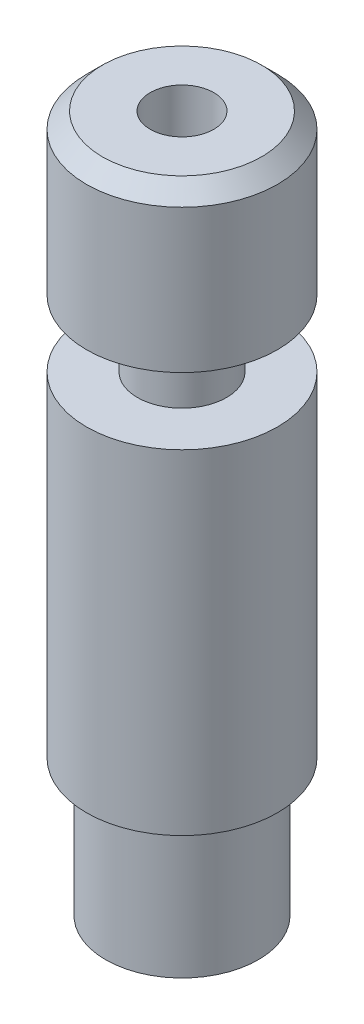
ISO-10303-21;
HEADER;
FILE_DESCRIPTION(('STEP AP214'),'2;1');
FILE_NAME('part.step','',(''),(''),'','','');
FILE_SCHEMA(('AUTOMOTIVE_DESIGN { 1 0 10303 214 1 1 1 1 }'));
ENDSEC;
DATA;
#1=APPLICATION_CONTEXT('core data for automotive mechanical design processes');
#2=APPLICATION_PROTOCOL_DEFINITION('international standard','automotive_design',2000,#1);
#3=PRODUCT_CONTEXT('',#1,'mechanical');
#4=PRODUCT('Part','Part','',(#3));
#5=PRODUCT_RELATED_PRODUCT_CATEGORY('part','',(#4));
#6=PRODUCT_DEFINITION_FORMATION('','',#4);
#7=PRODUCT_DEFINITION_CONTEXT('part definition',#1,'design');
#8=PRODUCT_DEFINITION('design','',#6,#7);
#9=PRODUCT_DEFINITION_SHAPE('','',#8);
#10=(LENGTH_UNIT() NAMED_UNIT(*) SI_UNIT(.MILLI.,.METRE.));
#11=(NAMED_UNIT(*) PLANE_ANGLE_UNIT() SI_UNIT($,.RADIAN.));
#12=(NAMED_UNIT(*) SI_UNIT($,.STERADIAN.) SOLID_ANGLE_UNIT());
#13=UNCERTAINTY_MEASURE_WITH_UNIT(LENGTH_MEASURE(1.E-05),#10,'distance_accuracy_value','');
#14=(GEOMETRIC_REPRESENTATION_CONTEXT(3) GLOBAL_UNCERTAINTY_ASSIGNED_CONTEXT((#13)) GLOBAL_UNIT_ASSIGNED_CONTEXT((#10,
#11,#12)) REPRESENTATION_CONTEXT('',''));
#15=CARTESIAN_POINT('',(0.,0.,0.));
#16=DIRECTION('',(0.,0.,1.));
#17=DIRECTION('',(1.,0.,0.));
#18=AXIS2_PLACEMENT_3D('',#15,#16,#17);
#19=CARTESIAN_POINT('',(1.,11.0943375672974,0.));
#20=DIRECTION('',(0.,-1.,0.));
#21=DIRECTION('',(0.,0.,-1.));
#22=AXIS2_PLACEMENT_3D('',#19,#20,#21);
#23=PLANE('',#22);
#24=CARTESIAN_POINT('',(0.,11.0943375672974,0.));
#25=DIRECTION('',(0.,1.,0.));
#26=DIRECTION('',(0.,0.,1.));
#27=AXIS2_PLACEMENT_3D('',#24,#25,#26);
#28=CIRCLE('',#27,1.);
#29=CARTESIAN_POINT('',(0.,11.0943375672974,1.));
#30=VERTEX_POINT('',#29);
#31=EDGE_CURVE('E74',#30,#30,#28,.T.);
#32=ORIENTED_EDGE('',*,*,#31,.F.);
#33=EDGE_LOOP('',(#32));
#34=FACE_BOUND('',#33,.T.);
#35=CARTESIAN_POINT('',(0.,11.0943375672974,0.));
#36=DIRECTION('',(0.,1.,0.));
#37=DIRECTION('',(0.,0.,1.));
#38=AXIS2_PLACEMENT_3D('',#35,#36,#37);
#39=CIRCLE('',#38,2.5);
#40=CARTESIAN_POINT('',(0.,11.0943375672974,2.5));
#41=VERTEX_POINT('',#40);
#42=EDGE_CURVE('E10',#41,#41,#39,.T.);
#43=ORIENTED_EDGE('',*,*,#42,.T.);
#44=EDGE_LOOP('',(#43));
#45=FACE_BOUND('',#44,.T.);
#46=ADVANCED_FACE('F31',(#34,#45),#23,.F.);
#47=CARTESIAN_POINT('',(0.,10.5943375672974,0.));
#48=DIRECTION('',(0.,-1.,0.));
#49=DIRECTION('',(0.,0.,-1.));
#50=AXIS2_PLACEMENT_3D('',#47,#48,#49);
#51=CONICAL_SURFACE('',#50,3.,0.785398163397447);
#52=ORIENTED_EDGE('',*,*,#42,.F.);
#53=EDGE_LOOP('',(#52));
#54=FACE_BOUND('',#53,.T.);
#55=CARTESIAN_POINT('',(0.,10.5943375672974,0.));
#56=DIRECTION('',(0.,1.,0.));
#57=DIRECTION('',(0.,0.,1.));
#58=AXIS2_PLACEMENT_3D('',#55,#56,#57);
#59=CIRCLE('',#58,3.);
#60=CARTESIAN_POINT('',(0.,10.5943375672974,3.));
#61=VERTEX_POINT('',#60);
#62=EDGE_CURVE('E37',#61,#61,#59,.T.);
#63=ORIENTED_EDGE('',*,*,#62,.T.);
#64=EDGE_LOOP('',(#63));
#65=FACE_BOUND('',#64,.T.);
#66=ADVANCED_FACE('F81',(#54,#65),#51,.T.);
#67=CARTESIAN_POINT('',(0.,11.0943375672974,0.));
#68=DIRECTION('',(0.,1.,0.));
#69=DIRECTION('',(0.,0.,1.));
#70=AXIS2_PLACEMENT_3D('',#67,#68,#69);
#71=CYLINDRICAL_SURFACE('',#70,3.);
#72=ORIENTED_EDGE('',*,*,#62,.F.);
#73=EDGE_LOOP('',(#72));
#74=FACE_BOUND('',#73,.T.);
#75=CARTESIAN_POINT('',(0.,6.09433756729741,0.));
#76=DIRECTION('',(0.,1.,0.));
#77=DIRECTION('',(0.,0.,1.));
#78=AXIS2_PLACEMENT_3D('',#75,#76,#77);
#79=CIRCLE('',#78,3.);
#80=CARTESIAN_POINT('',(0.,6.09433756729741,3.));
#81=VERTEX_POINT('',#80);
#82=EDGE_CURVE('E41',#81,#81,#79,.T.);
#83=ORIENTED_EDGE('',*,*,#82,.T.);
#84=EDGE_LOOP('',(#83));
#85=FACE_BOUND('',#84,.T.);
#86=ADVANCED_FACE('F85',(#74,#85),#71,.T.);
#87=CARTESIAN_POINT('',(3.,6.09433756729741,0.));
#88=DIRECTION('',(0.,1.,0.));
#89=DIRECTION('',(0.,0.,1.));
#90=AXIS2_PLACEMENT_3D('',#87,#88,#89);
#91=PLANE('',#90);
#92=ORIENTED_EDGE('',*,*,#82,.F.);
#93=EDGE_LOOP('',(#92));
#94=FACE_BOUND('',#93,.T.);
#95=CARTESIAN_POINT('',(0.,6.09433756729741,0.));
#96=DIRECTION('',(0.,1.,0.));
#97=DIRECTION('',(0.,0.,1.));
#98=AXIS2_PLACEMENT_3D('',#95,#96,#97);
#99=CIRCLE('',#98,1.4);
#100=CARTESIAN_POINT('',(0.,6.09433756729741,1.4));
#101=VERTEX_POINT('',#100);
#102=EDGE_CURVE('E45',#101,#101,#99,.T.);
#103=ORIENTED_EDGE('',*,*,#102,.T.);
#104=EDGE_LOOP('',(#103));
#105=FACE_BOUND('',#104,.T.);
#106=ADVANCED_FACE('F90',(#94,#105),#91,.F.);
#107=CARTESIAN_POINT('',(0.,11.0943375672974,0.));
#108=DIRECTION('',(0.,1.,0.));
#109=DIRECTION('',(0.,0.,1.));
#110=AXIS2_PLACEMENT_3D('',#107,#108,#109);
#111=CYLINDRICAL_SURFACE('',#110,1.4);
#112=ORIENTED_EDGE('',*,*,#102,.F.);
#113=EDGE_LOOP('',(#112));
#114=FACE_BOUND('',#113,.T.);
#115=CARTESIAN_POINT('',(0.,3.99433756729741,0.));
#116=DIRECTION('',(0.,1.,0.));
#117=DIRECTION('',(0.,0.,1.));
#118=AXIS2_PLACEMENT_3D('',#115,#116,#117);
#119=CIRCLE('',#118,1.4);
#120=CARTESIAN_POINT('',(0.,3.99433756729741,1.4));
#121=VERTEX_POINT('',#120);
#122=EDGE_CURVE('E50',#121,#121,#119,.T.);
#123=ORIENTED_EDGE('',*,*,#122,.T.);
#124=EDGE_LOOP('',(#123));
#125=FACE_BOUND('',#124,.T.);
#126=ADVANCED_FACE('F96',(#114,#125),#111,.T.);
#127=CARTESIAN_POINT('',(1.4,3.99433756729741,0.));
#128=DIRECTION('',(0.,-1.,0.));
#129=DIRECTION('',(0.,0.,-1.));
#130=AXIS2_PLACEMENT_3D('',#127,#128,#129);
#131=PLANE('',#130);
#132=ORIENTED_EDGE('',*,*,#122,.F.);
#133=EDGE_LOOP('',(#132));
#134=FACE_BOUND('',#133,.T.);
#135=CARTESIAN_POINT('',(0.,3.99433756729741,0.));
#136=DIRECTION('',(0.,1.,0.));
#137=DIRECTION('',(0.,0.,1.));
#138=AXIS2_PLACEMENT_3D('',#135,#136,#137);
#139=CIRCLE('',#138,3.);
#140=CARTESIAN_POINT('',(0.,3.99433756729741,3.));
#141=VERTEX_POINT('',#140);
#142=EDGE_CURVE('E53',#141,#141,#139,.T.);
#143=ORIENTED_EDGE('',*,*,#142,.T.);
#144=EDGE_LOOP('',(#143));
#145=FACE_BOUND('',#144,.T.);
#146=ADVANCED_FACE('F100',(#134,#145),#131,.F.);
#147=CARTESIAN_POINT('',(0.,11.0943375672974,0.));
#148=DIRECTION('',(0.,1.,0.));
#149=DIRECTION('',(0.,0.,1.));
#150=AXIS2_PLACEMENT_3D('',#147,#148,#149);
#151=CYLINDRICAL_SURFACE('',#150,3.);
#152=ORIENTED_EDGE('',*,*,#142,.F.);
#153=EDGE_LOOP('',(#152));
#154=FACE_BOUND('',#153,.T.);
#155=CARTESIAN_POINT('',(0.,-6.50566243270259,0.));
#156=DIRECTION('',(0.,1.,0.));
#157=DIRECTION('',(0.,0.,1.));
#158=AXIS2_PLACEMENT_3D('',#155,#156,#157);
#159=CIRCLE('',#158,3.);
#160=CARTESIAN_POINT('',(0.,-6.50566243270259,3.));
#161=VERTEX_POINT('',#160);
#162=EDGE_CURVE('E56',#161,#161,#159,.T.);
#163=ORIENTED_EDGE('',*,*,#162,.T.);
#164=EDGE_LOOP('',(#163));
#165=FACE_BOUND('',#164,.T.);
#166=ADVANCED_FACE('F104',(#154,#165),#151,.T.);
#167=CARTESIAN_POINT('',(2.40000000000001,-6.50566243270259,0.));
#168=DIRECTION('',(0.,1.,0.));
#169=DIRECTION('',(0.,0.,1.));
#170=AXIS2_PLACEMENT_3D('',#167,#168,#169);
#171=PLANE('',#170);
#172=ORIENTED_EDGE('',*,*,#162,.F.);
#173=EDGE_LOOP('',(#172));
#174=FACE_BOUND('',#173,.T.);
#175=CARTESIAN_POINT('',(0.,-6.50566243270259,0.));
#176=DIRECTION('',(0.,1.,0.));
#177=DIRECTION('',(0.,0.,1.));
#178=AXIS2_PLACEMENT_3D('',#175,#176,#177);
#179=CIRCLE('',#178,2.4);
#180=CARTESIAN_POINT('',(0.,-6.50566243270259,2.4));
#181=VERTEX_POINT('',#180);
#182=EDGE_CURVE('E59',#181,#181,#179,.T.);
#183=ORIENTED_EDGE('',*,*,#182,.T.);
#184=EDGE_LOOP('',(#183));
#185=FACE_BOUND('',#184,.T.);
#186=ADVANCED_FACE('F108',(#174,#185),#171,.F.);
#187=CARTESIAN_POINT('',(0.,11.0943375672974,0.));
#188=DIRECTION('',(0.,1.,0.));
#189=DIRECTION('',(0.,0.,1.));
#190=AXIS2_PLACEMENT_3D('',#187,#188,#189);
#191=CYLINDRICAL_SURFACE('',#190,2.4);
#192=ORIENTED_EDGE('',*,*,#182,.F.);
#193=EDGE_LOOP('',(#192));
#194=FACE_BOUND('',#193,.T.);
#195=CARTESIAN_POINT('',(0.,-10.8056624327026,0.));
#196=DIRECTION('',(0.,1.,0.));
#197=DIRECTION('',(0.,0.,1.));
#198=AXIS2_PLACEMENT_3D('',#195,#196,#197);
#199=CIRCLE('',#198,2.4);
#200=CARTESIAN_POINT('',(0.,-10.8056624327026,2.4));
#201=VERTEX_POINT('',#200);
#202=EDGE_CURVE('E62',#201,#201,#199,.T.);
#203=ORIENTED_EDGE('',*,*,#202,.T.);
#204=EDGE_LOOP('',(#203));
#205=FACE_BOUND('',#204,.T.);
#206=ADVANCED_FACE('F112',(#194,#205),#191,.T.);
#207=CARTESIAN_POINT('',(0.,-11.0943375672974,0.));
#208=DIRECTION('',(0.,1.,0.));
#209=DIRECTION('',(0.,0.,1.));
#210=AXIS2_PLACEMENT_3D('',#207,#208,#209);
#211=CONICAL_SURFACE('',#210,1.9,1.0471975511966);
#212=ORIENTED_EDGE('',*,*,#202,.F.);
#213=EDGE_LOOP('',(#212));
#214=FACE_BOUND('',#213,.T.);
#215=CARTESIAN_POINT('',(0.,-11.0943375672974,0.));
#216=DIRECTION('',(0.,1.,0.));
#217=DIRECTION('',(0.,0.,1.));
#218=AXIS2_PLACEMENT_3D('',#215,#216,#217);
#219=CIRCLE('',#218,1.9);
#220=CARTESIAN_POINT('',(0.,-11.0943375672974,1.9));
#221=VERTEX_POINT('',#220);
#222=EDGE_CURVE('E65',#221,#221,#219,.T.);
#223=ORIENTED_EDGE('',*,*,#222,.T.);
#224=EDGE_LOOP('',(#223));
#225=FACE_BOUND('',#224,.T.);
#226=ADVANCED_FACE('F116',(#214,#225),#211,.T.);
#227=CARTESIAN_POINT('',(1.4,-11.0943375672974,0.));
#228=DIRECTION('',(0.,1.,0.));
#229=DIRECTION('',(0.,0.,1.));
#230=AXIS2_PLACEMENT_3D('',#227,#228,#229);
#231=PLANE('',#230);
#232=ORIENTED_EDGE('',*,*,#222,.F.);
#233=EDGE_LOOP('',(#232));
#234=FACE_BOUND('',#233,.T.);
#235=CARTESIAN_POINT('',(0.,-11.0943375672974,0.));
#236=DIRECTION('',(0.,1.,0.));
#237=DIRECTION('',(0.,0.,1.));
#238=AXIS2_PLACEMENT_3D('',#235,#236,#237);
#239=CIRCLE('',#238,1.4);
#240=CARTESIAN_POINT('',(0.,-11.0943375672974,1.4));
#241=VERTEX_POINT('',#240);
#242=EDGE_CURVE('E68',#241,#241,#239,.T.);
#243=ORIENTED_EDGE('',*,*,#242,.T.);
#244=EDGE_LOOP('',(#243));
#245=FACE_BOUND('',#244,.T.);
#246=ADVANCED_FACE('F120',(#234,#245),#231,.F.);
#247=CARTESIAN_POINT('',(0.,-10.6943375672974,0.));
#248=DIRECTION('',(0.,-1.,0.));
#249=DIRECTION('',(0.,0.,-1.));
#250=AXIS2_PLACEMENT_3D('',#247,#248,#249);
#251=CONICAL_SURFACE('',#250,1.,0.785398163397451);
#252=ORIENTED_EDGE('',*,*,#242,.F.);
#253=EDGE_LOOP('',(#252));
#254=FACE_BOUND('',#253,.T.);
#255=CARTESIAN_POINT('',(0.,-10.6943375672974,0.));
#256=DIRECTION('',(0.,1.,0.));
#257=DIRECTION('',(0.,0.,1.));
#258=AXIS2_PLACEMENT_3D('',#255,#256,#257);
#259=CIRCLE('',#258,1.);
#260=CARTESIAN_POINT('',(0.,-10.6943375672974,1.));
#261=VERTEX_POINT('',#260);
#262=EDGE_CURVE('E71',#261,#261,#259,.T.);
#263=ORIENTED_EDGE('',*,*,#262,.T.);
#264=EDGE_LOOP('',(#263));
#265=FACE_BOUND('',#264,.T.);
#266=ADVANCED_FACE('F124',(#254,#265),#251,.F.);
#267=CARTESIAN_POINT('',(0.,11.0943375672974,0.));
#268=DIRECTION('',(0.,1.,0.));
#269=DIRECTION('',(0.,0.,1.));
#270=AXIS2_PLACEMENT_3D('',#267,#268,#269);
#271=CYLINDRICAL_SURFACE('',#270,1.);
#272=ORIENTED_EDGE('',*,*,#262,.F.);
#273=EDGE_LOOP('',(#272));
#274=FACE_BOUND('',#273,.T.);
#275=ORIENTED_EDGE('',*,*,#31,.T.);
#276=EDGE_LOOP('',(#275));
#277=FACE_BOUND('',#276,.T.);
#278=ADVANCED_FACE('F78',(#274,#277),#271,.F.);
#279=CLOSED_SHELL('',(#46,#66,#86,#106,#126,#146,#166,#186,#206,#226,#246,#266,#278));
#280=MANIFOLD_SOLID_BREP('B2',#279);
#281=ADVANCED_BREP_SHAPE_REPRESENTATION('',(#18,#280),#14);
#282=SHAPE_DEFINITION_REPRESENTATION(#9,#281);
ENDSEC;
END-ISO-10303-21;
